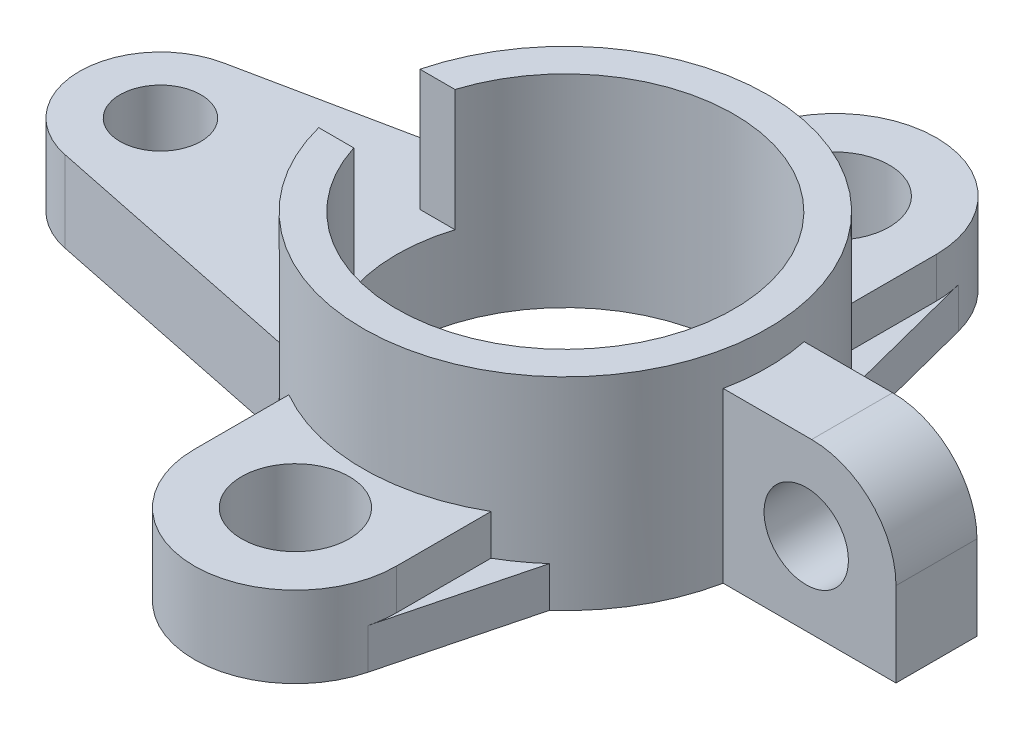
ISO-10303-21;
HEADER;
FILE_DESCRIPTION(('STEP AP214'),'2;1');
FILE_NAME('part.step','',(''),(''),'','','');
FILE_SCHEMA(('AUTOMOTIVE_DESIGN { 1 0 10303 214 1 1 1 1 }'));
ENDSEC;
DATA;
#1=APPLICATION_CONTEXT('core data for automotive mechanical design processes');
#2=APPLICATION_PROTOCOL_DEFINITION('international standard','automotive_design',2000,#1);
#3=PRODUCT_CONTEXT('',#1,'mechanical');
#4=PRODUCT('Part','Part','',(#3));
#5=PRODUCT_RELATED_PRODUCT_CATEGORY('part','',(#4));
#6=PRODUCT_DEFINITION_FORMATION('','',#4);
#7=PRODUCT_DEFINITION_CONTEXT('part definition',#1,'design');
#8=PRODUCT_DEFINITION('design','',#6,#7);
#9=PRODUCT_DEFINITION_SHAPE('','',#8);
#10=(LENGTH_UNIT() NAMED_UNIT(*) SI_UNIT(.MILLI.,.METRE.));
#11=(NAMED_UNIT(*) PLANE_ANGLE_UNIT() SI_UNIT($,.RADIAN.));
#12=(NAMED_UNIT(*) SI_UNIT($,.STERADIAN.) SOLID_ANGLE_UNIT());
#13=UNCERTAINTY_MEASURE_WITH_UNIT(LENGTH_MEASURE(1.E-05),#10,'distance_accuracy_value','');
#14=(GEOMETRIC_REPRESENTATION_CONTEXT(3) GLOBAL_UNCERTAINTY_ASSIGNED_CONTEXT((#13)) GLOBAL_UNIT_ASSIGNED_CONTEXT((#10,
#11,#12)) REPRESENTATION_CONTEXT('',''));
#15=CARTESIAN_POINT('',(0.,0.,0.));
#16=DIRECTION('',(0.,0.,1.));
#17=DIRECTION('',(1.,0.,0.));
#18=AXIS2_PLACEMENT_3D('',#15,#16,#17);
#19=CARTESIAN_POINT('',(0.,30.,0.));
#20=DIRECTION('',(0.,-1.,0.));
#21=DIRECTION('',(0.,0.,-1.));
#22=AXIS2_PLACEMENT_3D('',#19,#20,#21);
#23=CYLINDRICAL_SURFACE('',#22,30.);
#24=CARTESIAN_POINT('',(0.,0.,0.));
#25=DIRECTION('',(0.,1.,0.));
#26=DIRECTION('',(0.,0.,1.));
#27=AXIS2_PLACEMENT_3D('',#24,#25,#26);
#28=CIRCLE('',#27,30.);
#29=CARTESIAN_POINT('',(20.,0.,22.3606797749979));
#30=VERTEX_POINT('',#29);
#31=CARTESIAN_POINT('',(29.3938769133981,0.,6.));
#32=VERTEX_POINT('',#31);
#33=EDGE_CURVE('E455',#30,#32,#28,.T.);
#34=ORIENTED_EDGE('',*,*,#33,.T.);
#35=DIRECTION('',(0.,-1.,0.));
#36=VECTOR('',#35,1.);
#37=CARTESIAN_POINT('',(29.3938769133981,25.,6.));
#38=LINE('',#37,#36);
#39=CARTESIAN_POINT('',(29.3938769133981,25.,6.));
#40=VERTEX_POINT('',#39);
#41=EDGE_CURVE('E229',#40,#32,#38,.T.);
#42=ORIENTED_EDGE('',*,*,#41,.F.);
#43=CARTESIAN_POINT('',(0.,25.,0.));
#44=DIRECTION('',(0.,1.,0.));
#45=DIRECTION('',(0.,0.,1.));
#46=AXIS2_PLACEMENT_3D('',#43,#44,#45);
#47=CIRCLE('',#46,30.);
#48=CARTESIAN_POINT('',(29.3938769133981,25.,-6.));
#49=VERTEX_POINT('',#48);
#50=EDGE_CURVE('E252',#40,#49,#47,.T.);
#51=ORIENTED_EDGE('',*,*,#50,.T.);
#52=DIRECTION('',(0.,-1.,0.));
#53=VECTOR('',#52,1.);
#54=CARTESIAN_POINT('',(29.3938769133981,25.,-6.));
#55=LINE('',#54,#53);
#56=CARTESIAN_POINT('',(29.3938769133981,0.,-6.));
#57=VERTEX_POINT('',#56);
#58=EDGE_CURVE('E253',#49,#57,#55,.T.);
#59=ORIENTED_EDGE('',*,*,#58,.T.);
#60=CARTESIAN_POINT('',(20.,0.,-22.3606797749979));
#61=VERTEX_POINT('',#60);
#62=EDGE_CURVE('E456',#57,#61,#28,.T.);
#63=ORIENTED_EDGE('',*,*,#62,.T.);
#64=DIRECTION('',(0.,-1.,0.));
#65=VECTOR('',#64,1.);
#66=CARTESIAN_POINT('',(20.,6.,-22.3606797749979));
#67=LINE('',#66,#65);
#68=CARTESIAN_POINT('',(20.,6.,-22.3606797749979));
#69=VERTEX_POINT('',#68);
#70=EDGE_CURVE('E268',#69,#61,#67,.T.);
#71=ORIENTED_EDGE('',*,*,#70,.F.);
#72=CARTESIAN_POINT('',(0.,6.,0.));
#73=DIRECTION('',(0.,1.,0.));
#74=DIRECTION('',(0.,0.,1.));
#75=AXIS2_PLACEMENT_3D('',#72,#73,#74);
#76=CIRCLE('',#75,30.);
#77=CARTESIAN_POINT('',(14.978720200918,6.,-25.9930363971317));
#78=VERTEX_POINT('',#77);
#79=EDGE_CURVE('E265',#69,#78,#76,.T.);
#80=ORIENTED_EDGE('',*,*,#79,.T.);
#81=DIRECTION('',(0.,-1.,0.));
#82=VECTOR('',#81,1.);
#83=CARTESIAN_POINT('',(14.978720200918,12.,-25.9930363971317));
#84=LINE('',#83,#82);
#85=CARTESIAN_POINT('',(14.978720200918,12.,-25.9930363971317));
#86=VERTEX_POINT('',#85);
#87=EDGE_CURVE('E353',#86,#78,#84,.T.);
#88=ORIENTED_EDGE('',*,*,#87,.F.);
#89=CARTESIAN_POINT('',(0.,12.,0.));
#90=DIRECTION('',(0.,1.,0.));
#91=DIRECTION('',(0.,0.,1.));
#92=AXIS2_PLACEMENT_3D('',#89,#90,#91);
#93=CIRCLE('',#92,30.);
#94=CARTESIAN_POINT('',(-14.978720200918,12.,-25.9930363971317));
#95=VERTEX_POINT('',#94);
#96=EDGE_CURVE('E341',#86,#95,#93,.T.);
#97=ORIENTED_EDGE('',*,*,#96,.T.);
#98=DIRECTION('',(0.,-1.,0.));
#99=VECTOR('',#98,1.);
#100=CARTESIAN_POINT('',(-14.978720200918,12.,-25.9930363971317));
#101=LINE('',#100,#99);
#102=CARTESIAN_POINT('',(-14.978720200918,6.,-25.9930363971317));
#103=VERTEX_POINT('',#102);
#104=EDGE_CURVE('E356',#95,#103,#101,.T.);
#105=ORIENTED_EDGE('',*,*,#104,.T.);
#106=CARTESIAN_POINT('',(0.,6.,0.));
#107=DIRECTION('',(0.,1.,0.));
#108=DIRECTION('',(0.,0.,1.));
#109=AXIS2_PLACEMENT_3D('',#106,#107,#108);
#110=CIRCLE('',#109,30.);
#111=CARTESIAN_POINT('',(-20.,6.,-22.3606797749979));
#112=VERTEX_POINT('',#111);
#113=EDGE_CURVE('E321',#103,#112,#110,.T.);
#114=ORIENTED_EDGE('',*,*,#113,.T.);
#115=DIRECTION('',(0.,-1.,0.));
#116=VECTOR('',#115,1.);
#117=CARTESIAN_POINT('',(-20.,6.,-22.3606797749979));
#118=LINE('',#117,#116);
#119=CARTESIAN_POINT('',(-20.,0.,-22.3606797749979));
#120=VERTEX_POINT('',#119);
#121=EDGE_CURVE('E323',#112,#120,#118,.T.);
#122=ORIENTED_EDGE('',*,*,#121,.T.);
#123=CARTESIAN_POINT('',(-22.3606797749979,0.,-20.));
#124=VERTEX_POINT('',#123);
#125=EDGE_CURVE('E452',#120,#124,#28,.T.);
#126=ORIENTED_EDGE('',*,*,#125,.T.);
#127=DIRECTION('',(0.,-1.,0.));
#128=VECTOR('',#127,1.);
#129=CARTESIAN_POINT('',(-22.3606797749979,12.,-20.));
#130=LINE('',#129,#128);
#131=CARTESIAN_POINT('',(-22.3606797749979,12.,-20.));
#132=VERTEX_POINT('',#131);
#133=EDGE_CURVE('E426',#132,#124,#130,.T.);
#134=ORIENTED_EDGE('',*,*,#133,.F.);
#135=CARTESIAN_POINT('',(0.,12.,0.));
#136=DIRECTION('',(0.,1.,0.));
#137=DIRECTION('',(0.,0.,1.));
#138=AXIS2_PLACEMENT_3D('',#135,#136,#137);
#139=CIRCLE('',#138,30.);
#140=CARTESIAN_POINT('',(-29.0473750965556,12.,-7.5));
#141=VERTEX_POINT('',#140);
#142=EDGE_CURVE('E410',#132,#141,#139,.T.);
#143=ORIENTED_EDGE('',*,*,#142,.T.);
#144=DIRECTION('',(0.,-1.,0.));
#145=VECTOR('',#144,1.);
#146=CARTESIAN_POINT('',(-29.0473750965556,30.,-7.5));
#147=LINE('',#146,#145);
#148=CARTESIAN_POINT('',(-29.0473750965556,30.,-7.5));
#149=VERTEX_POINT('',#148);
#150=EDGE_CURVE('E459',#149,#141,#147,.T.);
#151=ORIENTED_EDGE('',*,*,#150,.F.);
#152=CARTESIAN_POINT('',(0.,30.,0.));
#153=DIRECTION('',(0.,1.,0.));
#154=DIRECTION('',(0.,0.,1.));
#155=AXIS2_PLACEMENT_3D('',#152,#153,#154);
#156=CIRCLE('',#155,30.);
#157=CARTESIAN_POINT('',(-29.0473750965556,30.,7.50000000000001));
#158=VERTEX_POINT('',#157);
#159=EDGE_CURVE('E445',#158,#149,#156,.T.);
#160=ORIENTED_EDGE('',*,*,#159,.F.);
#161=DIRECTION('',(0.,-1.,0.));
#162=VECTOR('',#161,1.);
#163=CARTESIAN_POINT('',(-29.0473750965556,30.,7.50000000000001));
#164=LINE('',#163,#162);
#165=CARTESIAN_POINT('',(-29.0473750965556,12.,7.50000000000001));
#166=VERTEX_POINT('',#165);
#167=EDGE_CURVE('E462',#158,#166,#164,.T.);
#168=ORIENTED_EDGE('',*,*,#167,.T.);
#169=CARTESIAN_POINT('',(-22.3606797749979,12.,20.));
#170=VERTEX_POINT('',#169);
#171=EDGE_CURVE('E406',#166,#170,#139,.T.);
#172=ORIENTED_EDGE('',*,*,#171,.T.);
#173=DIRECTION('',(0.,-1.,0.));
#174=VECTOR('',#173,1.);
#175=CARTESIAN_POINT('',(-22.3606797749979,12.,20.));
#176=LINE('',#175,#174);
#177=CARTESIAN_POINT('',(-22.3606797749979,0.,20.));
#178=VERTEX_POINT('',#177);
#179=EDGE_CURVE('E429',#170,#178,#176,.T.);
#180=ORIENTED_EDGE('',*,*,#179,.T.);
#181=CARTESIAN_POINT('',(-20.,0.,22.3606797749979));
#182=VERTEX_POINT('',#181);
#183=EDGE_CURVE('E442',#178,#182,#28,.T.);
#184=ORIENTED_EDGE('',*,*,#183,.T.);
#185=DIRECTION('',(0.,-1.,0.));
#186=VECTOR('',#185,1.);
#187=CARTESIAN_POINT('',(-20.,6.,22.3606797749979));
#188=LINE('',#187,#186);
#189=CARTESIAN_POINT('',(-20.,6.,22.3606797749979));
#190=VERTEX_POINT('',#189);
#191=EDGE_CURVE('E310',#190,#182,#188,.T.);
#192=ORIENTED_EDGE('',*,*,#191,.F.);
#193=CARTESIAN_POINT('',(0.,6.,0.));
#194=DIRECTION('',(0.,1.,0.));
#195=DIRECTION('',(0.,0.,1.));
#196=AXIS2_PLACEMENT_3D('',#193,#194,#195);
#197=CIRCLE('',#196,30.);
#198=CARTESIAN_POINT('',(-14.978720200918,6.,25.9930363971317));
#199=VERTEX_POINT('',#198);
#200=EDGE_CURVE('E299',#190,#199,#197,.T.);
#201=ORIENTED_EDGE('',*,*,#200,.T.);
#202=DIRECTION('',(0.,-1.,0.));
#203=VECTOR('',#202,1.);
#204=CARTESIAN_POINT('',(-14.978720200918,12.,25.9930363971317));
#205=LINE('',#204,#203);
#206=CARTESIAN_POINT('',(-14.978720200918,12.,25.9930363971317));
#207=VERTEX_POINT('',#206);
#208=EDGE_CURVE('E384',#207,#199,#205,.T.);
#209=ORIENTED_EDGE('',*,*,#208,.F.);
#210=CARTESIAN_POINT('',(0.,12.,0.));
#211=DIRECTION('',(0.,1.,0.));
#212=DIRECTION('',(0.,0.,1.));
#213=AXIS2_PLACEMENT_3D('',#210,#211,#212);
#214=CIRCLE('',#213,30.);
#215=CARTESIAN_POINT('',(14.978720200918,12.,25.9930363971317));
#216=VERTEX_POINT('',#215);
#217=EDGE_CURVE('E373',#207,#216,#214,.T.);
#218=ORIENTED_EDGE('',*,*,#217,.T.);
#219=DIRECTION('',(0.,-1.,0.));
#220=VECTOR('',#219,1.);
#221=CARTESIAN_POINT('',(14.978720200918,12.,25.9930363971317));
#222=LINE('',#221,#220);
#223=CARTESIAN_POINT('',(14.978720200918,6.,25.9930363971317));
#224=VERTEX_POINT('',#223);
#225=EDGE_CURVE('E387',#216,#224,#222,.T.);
#226=ORIENTED_EDGE('',*,*,#225,.T.);
#227=CARTESIAN_POINT('',(0.,6.,0.));
#228=DIRECTION('',(0.,1.,0.));
#229=DIRECTION('',(0.,0.,1.));
#230=AXIS2_PLACEMENT_3D('',#227,#228,#229);
#231=CIRCLE('',#230,30.);
#232=CARTESIAN_POINT('',(20.,6.,22.3606797749979));
#233=VERTEX_POINT('',#232);
#234=EDGE_CURVE('E282',#224,#233,#231,.T.);
#235=ORIENTED_EDGE('',*,*,#234,.T.);
#236=DIRECTION('',(0.,-1.,0.));
#237=VECTOR('',#236,1.);
#238=CARTESIAN_POINT('',(20.,6.,22.3606797749979));
#239=LINE('',#238,#237);
#240=EDGE_CURVE('E286',#233,#30,#239,.T.);
#241=ORIENTED_EDGE('',*,*,#240,.T.);
#242=EDGE_LOOP('',(#34,#42,#51,#59,#63,#71,#80,#88,#97,#105,#114,#122,#126,#134,#143,#151,#160,
#168,#172,#180,#184,#192,#201,#209,#218,#226,#235,#241));
#243=FACE_BOUND('',#242,.T.);
#244=ADVANCED_FACE('F33',(#243),#23,.T.);
#245=CARTESIAN_POINT('',(0.,12.,40.));
#246=DIRECTION('',(0.,-1.,0.));
#247=DIRECTION('',(0.,0.,-1.));
#248=AXIS2_PLACEMENT_3D('',#245,#246,#247);
#249=CYLINDRICAL_SURFACE('',#248,14.978720200918);
#250=DIRECTION('',(0.,-1.,0.));
#251=VECTOR('',#250,1.);
#252=CARTESIAN_POINT('',(14.5070849084416,6.,43.7291482025598));
#253=LINE('',#252,#251);
#254=CARTESIAN_POINT('',(14.5070849084416,6.,43.7291482025598));
#255=VERTEX_POINT('',#254);
#256=CARTESIAN_POINT('',(14.5070849084416,0.,43.7291482025598));
#257=VERTEX_POINT('',#256);
#258=EDGE_CURVE('E290',#255,#257,#253,.T.);
#259=ORIENTED_EDGE('',*,*,#258,.F.);
#260=CARTESIAN_POINT('',(0.,6.,40.));
#261=DIRECTION('',(0.,1.,0.));
#262=DIRECTION('',(0.,0.,1.));
#263=AXIS2_PLACEMENT_3D('',#260,#261,#262);
#264=CIRCLE('',#263,14.978720200918);
#265=CARTESIAN_POINT('',(14.978720200918,6.,40.));
#266=VERTEX_POINT('',#265);
#267=EDGE_CURVE('E277',#255,#266,#264,.T.);
#268=ORIENTED_EDGE('',*,*,#267,.T.);
#269=DIRECTION('',(0.,-1.,0.));
#270=VECTOR('',#269,1.);
#271=CARTESIAN_POINT('',(14.978720200918,12.,40.));
#272=LINE('',#271,#270);
#273=CARTESIAN_POINT('',(14.978720200918,12.,40.));
#274=VERTEX_POINT('',#273);
#275=EDGE_CURVE('E390',#274,#266,#272,.T.);
#276=ORIENTED_EDGE('',*,*,#275,.F.);
#277=CARTESIAN_POINT('',(0.,12.,40.));
#278=DIRECTION('',(0.,1.,0.));
#279=DIRECTION('',(0.,0.,1.));
#280=AXIS2_PLACEMENT_3D('',#277,#278,#279);
#281=CIRCLE('',#280,14.978720200918);
#282=CARTESIAN_POINT('',(-14.9787202009179,12.,40.));
#283=VERTEX_POINT('',#282);
#284=EDGE_CURVE('E366',#283,#274,#281,.T.);
#285=ORIENTED_EDGE('',*,*,#284,.F.);
#286=DIRECTION('',(0.,-1.,0.));
#287=VECTOR('',#286,1.);
#288=CARTESIAN_POINT('',(-14.9787202009179,12.,40.));
#289=LINE('',#288,#287);
#290=CARTESIAN_POINT('',(-14.9787202009179,6.,40.));
#291=VERTEX_POINT('',#290);
#292=EDGE_CURVE('E378',#283,#291,#289,.T.);
#293=ORIENTED_EDGE('',*,*,#292,.T.);
#294=CARTESIAN_POINT('',(0.,6.,40.));
#295=DIRECTION('',(0.,1.,0.));
#296=DIRECTION('',(0.,0.,1.));
#297=AXIS2_PLACEMENT_3D('',#294,#295,#296);
#298=CIRCLE('',#297,14.978720200918);
#299=CARTESIAN_POINT('',(-14.5070849084415,6.,43.7291482025598));
#300=VERTEX_POINT('',#299);
#301=EDGE_CURVE('E294',#291,#300,#298,.T.);
#302=ORIENTED_EDGE('',*,*,#301,.T.);
#303=DIRECTION('',(0.,-1.,0.));
#304=VECTOR('',#303,1.);
#305=CARTESIAN_POINT('',(-14.5070849084415,6.,43.7291482025598));
#306=LINE('',#305,#304);
#307=CARTESIAN_POINT('',(-14.5070849084415,0.,43.7291482025598));
#308=VERTEX_POINT('',#307);
#309=EDGE_CURVE('E305',#300,#308,#306,.T.);
#310=ORIENTED_EDGE('',*,*,#309,.T.);
#311=CARTESIAN_POINT('',(0.,0.,40.));
#312=DIRECTION('',(0.,1.,0.));
#313=DIRECTION('',(0.,0.,1.));
#314=AXIS2_PLACEMENT_3D('',#311,#312,#313);
#315=CIRCLE('',#314,14.978720200918);
#316=EDGE_CURVE('E367',#308,#257,#315,.T.);
#317=ORIENTED_EDGE('',*,*,#316,.T.);
#318=EDGE_LOOP('',(#259,#268,#276,#285,#293,#302,#310,#317));
#319=FACE_BOUND('',#318,.T.);
#320=ADVANCED_FACE('F502',(#319),#249,.T.);
#321=CARTESIAN_POINT('',(0.,12.,-40.));
#322=DIRECTION('',(0.,-1.,0.));
#323=DIRECTION('',(0.,0.,-1.));
#324=AXIS2_PLACEMENT_3D('',#321,#322,#323);
#325=CYLINDRICAL_SURFACE('',#324,14.978720200918);
#326=DIRECTION('',(0.,-1.,0.));
#327=VECTOR('',#326,1.);
#328=CARTESIAN_POINT('',(14.5070849084416,6.,-43.7291482025598));
#329=LINE('',#328,#327);
#330=CARTESIAN_POINT('',(14.5070849084416,6.,-43.7291482025598));
#331=VERTEX_POINT('',#330);
#332=CARTESIAN_POINT('',(14.5070849084416,0.,-43.7291482025598));
#333=VERTEX_POINT('',#332);
#334=EDGE_CURVE('E273',#331,#333,#329,.T.);
#335=ORIENTED_EDGE('',*,*,#334,.T.);
#336=CARTESIAN_POINT('',(0.,0.,-40.));
#337=DIRECTION('',(0.,1.,0.));
#338=DIRECTION('',(0.,0.,1.));
#339=AXIS2_PLACEMENT_3D('',#336,#337,#338);
#340=CIRCLE('',#339,14.978720200918);
#341=CARTESIAN_POINT('',(-14.5070849084416,0.,-43.7291482025598));
#342=VERTEX_POINT('',#341);
#343=EDGE_CURVE('E335',#342,#333,#340,.F.);
#344=ORIENTED_EDGE('',*,*,#343,.F.);
#345=DIRECTION('',(0.,-1.,0.));
#346=VECTOR('',#345,1.);
#347=CARTESIAN_POINT('',(-14.5070849084416,6.,-43.7291482025598));
#348=LINE('',#347,#346);
#349=CARTESIAN_POINT('',(-14.5070849084416,6.,-43.7291482025598));
#350=VERTEX_POINT('',#349);
#351=EDGE_CURVE('E327',#350,#342,#348,.T.);
#352=ORIENTED_EDGE('',*,*,#351,.F.);
#353=CARTESIAN_POINT('',(0.,6.,-40.));
#354=DIRECTION('',(0.,1.,0.));
#355=DIRECTION('',(0.,0.,1.));
#356=AXIS2_PLACEMENT_3D('',#353,#354,#355);
#357=CIRCLE('',#356,14.978720200918);
#358=CARTESIAN_POINT('',(-14.978720200918,6.,-40.));
#359=VERTEX_POINT('',#358);
#360=EDGE_CURVE('E315',#359,#350,#357,.F.);
#361=ORIENTED_EDGE('',*,*,#360,.F.);
#362=DIRECTION('',(0.,-1.,0.));
#363=VECTOR('',#362,1.);
#364=CARTESIAN_POINT('',(-14.978720200918,12.,-40.));
#365=LINE('',#364,#363);
#366=CARTESIAN_POINT('',(-14.978720200918,12.,-40.));
#367=VERTEX_POINT('',#366);
#368=EDGE_CURVE('E359',#367,#359,#365,.T.);
#369=ORIENTED_EDGE('',*,*,#368,.F.);
#370=CARTESIAN_POINT('',(0.,12.,-40.));
#371=DIRECTION('',(0.,1.,0.));
#372=DIRECTION('',(0.,0.,1.));
#373=AXIS2_PLACEMENT_3D('',#370,#371,#372);
#374=CIRCLE('',#373,14.978720200918);
#375=CARTESIAN_POINT('',(14.978720200918,12.,-40.));
#376=VERTEX_POINT('',#375);
#377=EDGE_CURVE('E334',#367,#376,#374,.F.);
#378=ORIENTED_EDGE('',*,*,#377,.T.);
#379=DIRECTION('',(0.,-1.,0.));
#380=VECTOR('',#379,1.);
#381=CARTESIAN_POINT('',(14.978720200918,12.,-40.));
#382=LINE('',#381,#380);
#383=CARTESIAN_POINT('',(14.978720200918,6.,-40.));
#384=VERTEX_POINT('',#383);
#385=EDGE_CURVE('E346',#376,#384,#382,.T.);
#386=ORIENTED_EDGE('',*,*,#385,.T.);
#387=CARTESIAN_POINT('',(0.,6.,-40.));
#388=DIRECTION('',(0.,1.,0.));
#389=DIRECTION('',(0.,0.,1.));
#390=AXIS2_PLACEMENT_3D('',#387,#388,#389);
#391=CIRCLE('',#390,14.978720200918);
#392=EDGE_CURVE('E261',#331,#384,#391,.F.);
#393=ORIENTED_EDGE('',*,*,#392,.F.);
#394=EDGE_LOOP('',(#335,#344,#352,#361,#369,#378,#386,#393));
#395=FACE_BOUND('',#394,.T.);
#396=ADVANCED_FACE('F508',(#395),#325,.T.);
#397=CARTESIAN_POINT('',(0.,30.,0.));
#398=DIRECTION('',(0.,-1.,0.));
#399=DIRECTION('',(0.,0.,-1.));
#400=AXIS2_PLACEMENT_3D('',#397,#398,#399);
#401=CYLINDRICAL_SURFACE('',#400,25.);
#402=CARTESIAN_POINT('',(0.,0.,0.));
#403=DIRECTION('',(0.,1.,0.));
#404=DIRECTION('',(0.,0.,1.));
#405=AXIS2_PLACEMENT_3D('',#402,#403,#404);
#406=CIRCLE('',#405,25.);
#407=CARTESIAN_POINT('',(0.,0.,25.));
#408=VERTEX_POINT('',#407);
#409=EDGE_CURVE('E437',#408,#408,#406,.T.);
#410=ORIENTED_EDGE('',*,*,#409,.F.);
#411=EDGE_LOOP('',(#410));
#412=FACE_BOUND('',#411,.T.);
#413=CARTESIAN_POINT('',(0.,12.,0.));
#414=DIRECTION('',(0.,1.,0.));
#415=DIRECTION('',(0.,0.,1.));
#416=AXIS2_PLACEMENT_3D('',#413,#414,#415);
#417=CIRCLE('',#416,25.);
#418=CARTESIAN_POINT('',(-23.8484800354236,12.,-7.5));
#419=VERTEX_POINT('',#418);
#420=CARTESIAN_POINT('',(-23.8484800354236,12.,7.5));
#421=VERTEX_POINT('',#420);
#422=EDGE_CURVE('E412',#419,#421,#417,.T.);
#423=ORIENTED_EDGE('',*,*,#422,.T.);
#424=DIRECTION('',(0.,-1.,0.));
#425=VECTOR('',#424,1.);
#426=CARTESIAN_POINT('',(-23.8484800354236,30.,7.5));
#427=LINE('',#426,#425);
#428=CARTESIAN_POINT('',(-23.8484800354236,30.,7.5));
#429=VERTEX_POINT('',#428);
#430=EDGE_CURVE('E465',#429,#421,#427,.T.);
#431=ORIENTED_EDGE('',*,*,#430,.F.);
#432=CARTESIAN_POINT('',(0.,30.,0.));
#433=DIRECTION('',(0.,1.,0.));
#434=DIRECTION('',(0.,0.,1.));
#435=AXIS2_PLACEMENT_3D('',#432,#433,#434);
#436=CIRCLE('',#435,25.);
#437=CARTESIAN_POINT('',(-23.8484800354236,30.,-7.5));
#438=VERTEX_POINT('',#437);
#439=EDGE_CURVE('E438',#429,#438,#436,.T.);
#440=ORIENTED_EDGE('',*,*,#439,.T.);
#441=DIRECTION('',(0.,-1.,0.));
#442=VECTOR('',#441,1.);
#443=CARTESIAN_POINT('',(-23.8484800354236,30.,-7.5));
#444=LINE('',#443,#442);
#445=EDGE_CURVE('E449',#438,#419,#444,.T.);
#446=ORIENTED_EDGE('',*,*,#445,.T.);
#447=EDGE_LOOP('',(#423,#431,#440,#446));
#448=FACE_BOUND('',#447,.T.);
#449=ADVANCED_FACE('F517',(#412,#448),#401,.F.);
#450=CARTESIAN_POINT('',(0.,30.,7.5));
#451=DIRECTION('',(0.,0.,-1.));
#452=DIRECTION('',(-1.,0.,0.));
#453=AXIS2_PLACEMENT_3D('',#450,#451,#452);
#454=PLANE('',#453);
#455=DIRECTION('',(1.,0.,0.));
#456=VECTOR('',#455,1.);
#457=CARTESIAN_POINT('',(0.,12.,7.5));
#458=LINE('',#457,#456);
#459=EDGE_CURVE('E409',#166,#421,#458,.T.);
#460=ORIENTED_EDGE('',*,*,#459,.F.);
#461=ORIENTED_EDGE('',*,*,#167,.F.);
#462=DIRECTION('',(1.,0.,0.));
#463=VECTOR('',#462,1.);
#464=CARTESIAN_POINT('',(0.,30.,7.5));
#465=LINE('',#464,#463);
#466=EDGE_CURVE('E441',#158,#429,#465,.T.);
#467=ORIENTED_EDGE('',*,*,#466,.T.);
#468=ORIENTED_EDGE('',*,*,#430,.T.);
#469=EDGE_LOOP('',(#460,#461,#467,#468));
#470=FACE_BOUND('',#469,.T.);
#471=ADVANCED_FACE('F515',(#470),#454,.T.);
#472=CARTESIAN_POINT('',(0.,30.,-7.50000000000001));
#473=DIRECTION('',(0.,0.,-1.));
#474=DIRECTION('',(-1.,0.,0.));
#475=AXIS2_PLACEMENT_3D('',#472,#473,#474);
#476=PLANE('',#475);
#477=ORIENTED_EDGE('',*,*,#150,.T.);
#478=DIRECTION('',(1.,0.,0.));
#479=VECTOR('',#478,1.);
#480=CARTESIAN_POINT('',(0.,12.,-7.50000000000001));
#481=LINE('',#480,#479);
#482=EDGE_CURVE('E415',#141,#419,#481,.T.);
#483=ORIENTED_EDGE('',*,*,#482,.T.);
#484=ORIENTED_EDGE('',*,*,#445,.F.);
#485=DIRECTION('',(1.,0.,0.));
#486=VECTOR('',#485,1.);
#487=CARTESIAN_POINT('',(0.,30.,-7.50000000000001));
#488=LINE('',#487,#486);
#489=EDGE_CURVE('E447',#149,#438,#488,.T.);
#490=ORIENTED_EDGE('',*,*,#489,.F.);
#491=EDGE_LOOP('',(#477,#483,#484,#490));
#492=FACE_BOUND('',#491,.T.);
#493=ADVANCED_FACE('F513',(#492),#476,.F.);
#494=CARTESIAN_POINT('',(0.,30.,0.));
#495=DIRECTION('',(0.,1.,0.));
#496=DIRECTION('',(0.,0.,1.));
#497=AXIS2_PLACEMENT_3D('',#494,#495,#496);
#498=PLANE('',#497);
#499=ORIENTED_EDGE('',*,*,#439,.F.);
#500=ORIENTED_EDGE('',*,*,#466,.F.);
#501=ORIENTED_EDGE('',*,*,#159,.T.);
#502=ORIENTED_EDGE('',*,*,#489,.T.);
#503=EDGE_LOOP('',(#499,#500,#501,#502));
#504=FACE_BOUND('',#503,.T.);
#505=ADVANCED_FACE('F537',(#504),#498,.T.);
#506=CARTESIAN_POINT('',(0.,0.,0.));
#507=DIRECTION('',(0.,1.,0.));
#508=DIRECTION('',(0.,0.,1.));
#509=AXIS2_PLACEMENT_3D('',#506,#507,#508);
#510=PLANE('',#509);
#511=ORIENTED_EDGE('',*,*,#33,.F.);
#512=DIRECTION('',(0.248963072448023,0.,-0.968512978001452));
#513=VECTOR('',#512,1.);
#514=CARTESIAN_POINT('',(24.1520435768026,0.,6.20845266027018));
#515=LINE('',#514,#513);
#516=EDGE_CURVE('E276',#257,#30,#515,.T.);
#517=ORIENTED_EDGE('',*,*,#516,.F.);
#518=ORIENTED_EDGE('',*,*,#316,.F.);
#519=DIRECTION('',(-0.248963072448023,0.,-0.968512978001452));
#520=VECTOR('',#519,1.);
#521=CARTESIAN_POINT('',(-24.1520435768026,0.,6.20845266027018));
#522=LINE('',#521,#520);
#523=EDGE_CURVE('E293',#308,#182,#522,.T.);
#524=ORIENTED_EDGE('',*,*,#523,.T.);
#525=ORIENTED_EDGE('',*,*,#183,.F.);
#526=DIRECTION('',(0.979461667767342,0.,0.201630457457243));
#527=VECTOR('',#526,1.);
#528=CARTESIAN_POINT('',(-4.85885597195194,0.,23.6028982612339));
#529=LINE('',#528,#527);
#530=CARTESIAN_POINT('',(-62.4195654894869,0.,11.7535400132081));
#531=VERTEX_POINT('',#530);
#532=EDGE_CURVE('E398',#531,#178,#529,.T.);
#533=ORIENTED_EDGE('',*,*,#532,.F.);
#534=CARTESIAN_POINT('',(-60.,0.,0.));
#535=DIRECTION('',(0.,1.,0.));
#536=DIRECTION('',(0.,0.,1.));
#537=AXIS2_PLACEMENT_3D('',#534,#535,#536);
#538=CIRCLE('',#537,12.);
#539=CARTESIAN_POINT('',(-62.4195654894869,0.,-11.7535400132081));
#540=VERTEX_POINT('',#539);
#541=EDGE_CURVE('E422',#540,#531,#538,.T.);
#542=ORIENTED_EDGE('',*,*,#541,.F.);
#543=DIRECTION('',(0.979461667767342,0.,-0.201630457457243));
#544=VECTOR('',#543,1.);
#545=CARTESIAN_POINT('',(-4.85885597195195,0.,-23.6028982612339));
#546=LINE('',#545,#544);
#547=EDGE_CURVE('E419',#540,#124,#546,.T.);
#548=ORIENTED_EDGE('',*,*,#547,.T.);
#549=ORIENTED_EDGE('',*,*,#125,.F.);
#550=DIRECTION('',(-0.248963072448022,0.,0.968512978001452));
#551=VECTOR('',#550,1.);
#552=CARTESIAN_POINT('',(-24.1520435768026,0.,-6.20845266027016));
#553=LINE('',#552,#551);
#554=EDGE_CURVE('E312',#342,#120,#553,.T.);
#555=ORIENTED_EDGE('',*,*,#554,.F.);
#556=ORIENTED_EDGE('',*,*,#343,.T.);
#557=DIRECTION('',(0.248963072448023,0.,0.968512978001452));
#558=VECTOR('',#557,1.);
#559=CARTESIAN_POINT('',(24.1520435768026,0.,-6.20845266027019));
#560=LINE('',#559,#558);
#561=EDGE_CURVE('E258',#333,#61,#560,.T.);
#562=ORIENTED_EDGE('',*,*,#561,.T.);
#563=ORIENTED_EDGE('',*,*,#62,.F.);
#564=DIRECTION('',(-1.,0.,0.));
#565=VECTOR('',#564,1.);
#566=CARTESIAN_POINT('',(0.,0.,-6.00000000000001));
#567=LINE('',#566,#565);
#568=CARTESIAN_POINT('',(55.,0.,-6.));
#569=VERTEX_POINT('',#568);
#570=EDGE_CURVE('E239',#569,#57,#567,.T.);
#571=ORIENTED_EDGE('',*,*,#570,.F.);
#572=DIRECTION('',(0.,0.,-1.));
#573=VECTOR('',#572,1.);
#574=CARTESIAN_POINT('',(55.,0.,0.));
#575=LINE('',#574,#573);
#576=CARTESIAN_POINT('',(55.,0.,6.));
#577=VERTEX_POINT('',#576);
#578=EDGE_CURVE('E224',#577,#569,#575,.T.);
#579=ORIENTED_EDGE('',*,*,#578,.F.);
#580=DIRECTION('',(-1.,0.,0.));
#581=VECTOR('',#580,1.);
#582=CARTESIAN_POINT('',(0.,0.,6.00000000000001));
#583=LINE('',#582,#581);
#584=EDGE_CURVE('E237',#577,#32,#583,.T.);
#585=ORIENTED_EDGE('',*,*,#584,.T.);
#586=EDGE_LOOP('',(#511,#517,#518,#524,#525,#533,#542,#548,#549,#555,#556,#562,#563,#571,#579,#585));
#587=FACE_BOUND('',#586,.T.);
#588=ORIENTED_EDGE('',*,*,#409,.T.);
#589=EDGE_LOOP('',(#588));
#590=FACE_BOUND('',#589,.T.);
#591=CARTESIAN_POINT('',(-60.,0.,0.));
#592=DIRECTION('',(0.,1.,0.));
#593=DIRECTION('',(0.,0.,1.));
#594=AXIS2_PLACEMENT_3D('',#591,#592,#593);
#595=CIRCLE('',#594,6.);
#596=CARTESIAN_POINT('',(-60.,0.,6.00000000000001));
#597=VERTEX_POINT('',#596);
#598=EDGE_CURVE('E393',#597,#597,#595,.T.);
#599=ORIENTED_EDGE('',*,*,#598,.T.);
#600=EDGE_LOOP('',(#599));
#601=FACE_BOUND('',#600,.T.);
#602=CARTESIAN_POINT('',(0.,0.,40.));
#603=DIRECTION('',(0.,1.,0.));
#604=DIRECTION('',(0.,0.,1.));
#605=AXIS2_PLACEMENT_3D('',#602,#603,#604);
#606=CIRCLE('',#605,7.98774976804091);
#607=CARTESIAN_POINT('',(0.,0.,47.9877497680409));
#608=VERTEX_POINT('',#607);
#609=EDGE_CURVE('E362',#608,#608,#606,.F.);
#610=ORIENTED_EDGE('',*,*,#609,.F.);
#611=EDGE_LOOP('',(#610));
#612=FACE_BOUND('',#611,.T.);
#613=CARTESIAN_POINT('',(0.,0.,-40.));
#614=DIRECTION('',(0.,1.,0.));
#615=DIRECTION('',(0.,0.,1.));
#616=AXIS2_PLACEMENT_3D('',#613,#614,#615);
#617=CIRCLE('',#616,7.98774976804091);
#618=CARTESIAN_POINT('',(0.,0.,-32.0122502319591));
#619=VERTEX_POINT('',#618);
#620=EDGE_CURVE('E330',#619,#619,#617,.T.);
#621=ORIENTED_EDGE('',*,*,#620,.T.);
#622=EDGE_LOOP('',(#621));
#623=FACE_BOUND('',#622,.T.);
#624=ADVANCED_FACE('F235',(#587,#590,#601,#612,#623),#510,.F.);
#625=CARTESIAN_POINT('',(-4.85885597195195,12.,-23.6028982612339));
#626=DIRECTION('',(-0.201630457457243,0.,-0.979461667767342));
#627=DIRECTION('',(-0.979461667767342,0.,0.201630457457243));
#628=AXIS2_PLACEMENT_3D('',#625,#626,#627);
#629=PLANE('',#628);
#630=ORIENTED_EDGE('',*,*,#547,.F.);
#631=DIRECTION('',(0.,-1.,0.));
#632=VECTOR('',#631,1.);
#633=CARTESIAN_POINT('',(-62.4195654894869,12.,-11.7535400132081));
#634=LINE('',#633,#632);
#635=CARTESIAN_POINT('',(-62.4195654894869,12.,-11.7535400132081));
#636=VERTEX_POINT('',#635);
#637=EDGE_CURVE('E435',#636,#540,#634,.T.);
#638=ORIENTED_EDGE('',*,*,#637,.F.);
#639=DIRECTION('',(0.979461667767342,0.,-0.201630457457243));
#640=VECTOR('',#639,1.);
#641=CARTESIAN_POINT('',(-4.85885597195195,12.,-23.6028982612339));
#642=LINE('',#641,#640);
#643=EDGE_CURVE('E397',#636,#132,#642,.T.);
#644=ORIENTED_EDGE('',*,*,#643,.T.);
#645=ORIENTED_EDGE('',*,*,#133,.T.);
#646=EDGE_LOOP('',(#630,#638,#644,#645));
#647=FACE_BOUND('',#646,.T.);
#648=ADVANCED_FACE('F547',(#647),#629,.T.);
#649=CARTESIAN_POINT('',(-60.,12.,0.));
#650=DIRECTION('',(0.,-1.,0.));
#651=DIRECTION('',(0.,0.,-1.));
#652=AXIS2_PLACEMENT_3D('',#649,#650,#651);
#653=CYLINDRICAL_SURFACE('',#652,12.);
#654=ORIENTED_EDGE('',*,*,#541,.T.);
#655=DIRECTION('',(0.,-1.,0.));
#656=VECTOR('',#655,1.);
#657=CARTESIAN_POINT('',(-62.4195654894869,12.,11.7535400132081));
#658=LINE('',#657,#656);
#659=CARTESIAN_POINT('',(-62.4195654894869,12.,11.7535400132081));
#660=VERTEX_POINT('',#659);
#661=EDGE_CURVE('E432',#660,#531,#658,.T.);
#662=ORIENTED_EDGE('',*,*,#661,.F.);
#663=CARTESIAN_POINT('',(-60.,12.,0.));
#664=DIRECTION('',(0.,1.,0.));
#665=DIRECTION('',(0.,0.,1.));
#666=AXIS2_PLACEMENT_3D('',#663,#664,#665);
#667=CIRCLE('',#666,12.);
#668=EDGE_CURVE('E401',#636,#660,#667,.T.);
#669=ORIENTED_EDGE('',*,*,#668,.F.);
#670=ORIENTED_EDGE('',*,*,#637,.T.);
#671=EDGE_LOOP('',(#654,#662,#669,#670));
#672=FACE_BOUND('',#671,.T.);
#673=ADVANCED_FACE('F552',(#672),#653,.T.);
#674=CARTESIAN_POINT('',(-4.85885597195194,12.,23.6028982612339));
#675=DIRECTION('',(0.201630457457243,0.,-0.979461667767342));
#676=DIRECTION('',(-0.979461667767342,0.,-0.201630457457243));
#677=AXIS2_PLACEMENT_3D('',#674,#675,#676);
#678=PLANE('',#677);
#679=ORIENTED_EDGE('',*,*,#532,.T.);
#680=ORIENTED_EDGE('',*,*,#179,.F.);
#681=DIRECTION('',(0.979461667767342,0.,0.201630457457243));
#682=VECTOR('',#681,1.);
#683=CARTESIAN_POINT('',(-4.85885597195194,12.,23.6028982612339));
#684=LINE('',#683,#682);
#685=EDGE_CURVE('E404',#660,#170,#684,.T.);
#686=ORIENTED_EDGE('',*,*,#685,.F.);
#687=ORIENTED_EDGE('',*,*,#661,.T.);
#688=EDGE_LOOP('',(#679,#680,#686,#687));
#689=FACE_BOUND('',#688,.T.);
#690=ADVANCED_FACE('F555',(#689),#678,.F.);
#691=CARTESIAN_POINT('',(-60.,12.,0.));
#692=DIRECTION('',(0.,-1.,0.));
#693=DIRECTION('',(0.,0.,-1.));
#694=AXIS2_PLACEMENT_3D('',#691,#692,#693);
#695=CYLINDRICAL_SURFACE('',#694,6.);
#696=CARTESIAN_POINT('',(-60.,12.,0.));
#697=DIRECTION('',(0.,1.,0.));
#698=DIRECTION('',(0.,0.,1.));
#699=AXIS2_PLACEMENT_3D('',#696,#697,#698);
#700=CIRCLE('',#699,6.);
#701=CARTESIAN_POINT('',(-60.,12.,6.00000000000001));
#702=VERTEX_POINT('',#701);
#703=EDGE_CURVE('E394',#702,#702,#700,.T.);
#704=ORIENTED_EDGE('',*,*,#703,.T.);
#705=EDGE_LOOP('',(#704));
#706=FACE_BOUND('',#705,.T.);
#707=ORIENTED_EDGE('',*,*,#598,.F.);
#708=EDGE_LOOP('',(#707));
#709=FACE_BOUND('',#708,.T.);
#710=ADVANCED_FACE('F640',(#706,#709),#695,.F.);
#711=CARTESIAN_POINT('',(0.,12.,0.));
#712=DIRECTION('',(0.,1.,0.));
#713=DIRECTION('',(0.,0.,1.));
#714=AXIS2_PLACEMENT_3D('',#711,#712,#713);
#715=PLANE('',#714);
#716=ORIENTED_EDGE('',*,*,#703,.F.);
#717=EDGE_LOOP('',(#716));
#718=FACE_BOUND('',#717,.T.);
#719=ORIENTED_EDGE('',*,*,#643,.F.);
#720=ORIENTED_EDGE('',*,*,#668,.T.);
#721=ORIENTED_EDGE('',*,*,#685,.T.);
#722=ORIENTED_EDGE('',*,*,#171,.F.);
#723=ORIENTED_EDGE('',*,*,#459,.T.);
#724=ORIENTED_EDGE('',*,*,#422,.F.);
#725=ORIENTED_EDGE('',*,*,#482,.F.);
#726=ORIENTED_EDGE('',*,*,#142,.F.);
#727=EDGE_LOOP('',(#719,#720,#721,#722,#723,#724,#725,#726));
#728=FACE_BOUND('',#727,.T.);
#729=ADVANCED_FACE('F543',(#718,#728),#715,.T.);
#730=CARTESIAN_POINT('',(14.978720200918,12.,0.));
#731=DIRECTION('',(-1.,0.,0.));
#732=DIRECTION('',(0.,0.,1.));
#733=AXIS2_PLACEMENT_3D('',#730,#731,#732);
#734=PLANE('',#733);
#735=ORIENTED_EDGE('',*,*,#275,.T.);
#736=DIRECTION('',(0.,0.,-1.));
#737=VECTOR('',#736,1.);
#738=CARTESIAN_POINT('',(14.978720200918,6.,0.));
#739=LINE('',#738,#737);
#740=EDGE_CURVE('E284',#266,#224,#739,.T.);
#741=ORIENTED_EDGE('',*,*,#740,.T.);
#742=ORIENTED_EDGE('',*,*,#225,.F.);
#743=DIRECTION('',(0.,0.,-1.));
#744=VECTOR('',#743,1.);
#745=CARTESIAN_POINT('',(14.978720200918,12.,0.));
#746=LINE('',#745,#744);
#747=EDGE_CURVE('E370',#274,#216,#746,.T.);
#748=ORIENTED_EDGE('',*,*,#747,.F.);
#749=EDGE_LOOP('',(#735,#741,#742,#748));
#750=FACE_BOUND('',#749,.T.);
#751=ADVANCED_FACE('F576',(#750),#734,.F.);
#752=CARTESIAN_POINT('',(0.,12.,40.));
#753=DIRECTION('',(0.,-1.,0.));
#754=DIRECTION('',(0.,0.,-1.));
#755=AXIS2_PLACEMENT_3D('',#752,#753,#754);
#756=CYLINDRICAL_SURFACE('',#755,7.98774976804091);
#757=CARTESIAN_POINT('',(0.,12.,40.));
#758=DIRECTION('',(0.,1.,0.));
#759=DIRECTION('',(0.,0.,1.));
#760=AXIS2_PLACEMENT_3D('',#757,#758,#759);
#761=CIRCLE('',#760,7.98774976804091);
#762=CARTESIAN_POINT('',(0.,12.,47.9877497680409));
#763=VERTEX_POINT('',#762);
#764=EDGE_CURVE('E363',#763,#763,#761,.F.);
#765=ORIENTED_EDGE('',*,*,#764,.F.);
#766=EDGE_LOOP('',(#765));
#767=FACE_BOUND('',#766,.T.);
#768=ORIENTED_EDGE('',*,*,#609,.T.);
#769=EDGE_LOOP('',(#768));
#770=FACE_BOUND('',#769,.T.);
#771=ADVANCED_FACE('F632',(#767,#770),#756,.F.);
#772=CARTESIAN_POINT('',(-14.978720200918,12.,0.));
#773=DIRECTION('',(-1.,0.,0.));
#774=DIRECTION('',(0.,0.,1.));
#775=AXIS2_PLACEMENT_3D('',#772,#773,#774);
#776=PLANE('',#775);
#777=DIRECTION('',(0.,0.,-1.));
#778=VECTOR('',#777,1.);
#779=CARTESIAN_POINT('',(-14.978720200918,6.,0.));
#780=LINE('',#779,#778);
#781=EDGE_CURVE('E297',#291,#199,#780,.T.);
#782=ORIENTED_EDGE('',*,*,#781,.F.);
#783=ORIENTED_EDGE('',*,*,#292,.F.);
#784=DIRECTION('',(0.,0.,-1.));
#785=VECTOR('',#784,1.);
#786=CARTESIAN_POINT('',(-14.978720200918,12.,0.));
#787=LINE('',#786,#785);
#788=EDGE_CURVE('E375',#283,#207,#787,.T.);
#789=ORIENTED_EDGE('',*,*,#788,.T.);
#790=ORIENTED_EDGE('',*,*,#208,.T.);
#791=EDGE_LOOP('',(#782,#783,#789,#790));
#792=FACE_BOUND('',#791,.T.);
#793=ADVANCED_FACE('F568',(#792),#776,.T.);
#794=CARTESIAN_POINT('',(0.,12.,0.));
#795=DIRECTION('',(0.,1.,0.));
#796=DIRECTION('',(0.,0.,1.));
#797=AXIS2_PLACEMENT_3D('',#794,#795,#796);
#798=PLANE('',#797);
#799=ORIENTED_EDGE('',*,*,#764,.T.);
#800=EDGE_LOOP('',(#799));
#801=FACE_BOUND('',#800,.T.);
#802=ORIENTED_EDGE('',*,*,#284,.T.);
#803=ORIENTED_EDGE('',*,*,#747,.T.);
#804=ORIENTED_EDGE('',*,*,#217,.F.);
#805=ORIENTED_EDGE('',*,*,#788,.F.);
#806=EDGE_LOOP('',(#802,#803,#804,#805));
#807=FACE_BOUND('',#806,.T.);
#808=ADVANCED_FACE('F572',(#801,#807),#798,.T.);
#809=CARTESIAN_POINT('',(-14.978720200918,12.,0.));
#810=DIRECTION('',(1.,0.,0.));
#811=DIRECTION('',(0.,0.,-1.));
#812=AXIS2_PLACEMENT_3D('',#809,#810,#811);
#813=PLANE('',#812);
#814=ORIENTED_EDGE('',*,*,#368,.T.);
#815=DIRECTION('',(0.,0.,1.));
#816=VECTOR('',#815,1.);
#817=CARTESIAN_POINT('',(-14.978720200918,6.,0.));
#818=LINE('',#817,#816);
#819=EDGE_CURVE('E313',#359,#103,#818,.T.);
#820=ORIENTED_EDGE('',*,*,#819,.T.);
#821=ORIENTED_EDGE('',*,*,#104,.F.);
#822=DIRECTION('',(0.,0.,1.));
#823=VECTOR('',#822,1.);
#824=CARTESIAN_POINT('',(-14.978720200918,12.,0.));
#825=LINE('',#824,#823);
#826=EDGE_CURVE('E338',#367,#95,#825,.T.);
#827=ORIENTED_EDGE('',*,*,#826,.F.);
#828=EDGE_LOOP('',(#814,#820,#821,#827));
#829=FACE_BOUND('',#828,.T.);
#830=ADVANCED_FACE('F602',(#829),#813,.F.);
#831=CARTESIAN_POINT('',(0.,12.,-40.));
#832=DIRECTION('',(0.,-1.,0.));
#833=DIRECTION('',(0.,0.,-1.));
#834=AXIS2_PLACEMENT_3D('',#831,#832,#833);
#835=CYLINDRICAL_SURFACE('',#834,7.98774976804091);
#836=CARTESIAN_POINT('',(0.,12.,-40.));
#837=DIRECTION('',(0.,1.,0.));
#838=DIRECTION('',(0.,0.,1.));
#839=AXIS2_PLACEMENT_3D('',#836,#837,#838);
#840=CIRCLE('',#839,7.98774976804091);
#841=CARTESIAN_POINT('',(0.,12.,-32.0122502319591));
#842=VERTEX_POINT('',#841);
#843=EDGE_CURVE('E331',#842,#842,#840,.T.);
#844=ORIENTED_EDGE('',*,*,#843,.T.);
#845=EDGE_LOOP('',(#844));
#846=FACE_BOUND('',#845,.T.);
#847=ORIENTED_EDGE('',*,*,#620,.F.);
#848=EDGE_LOOP('',(#847));
#849=FACE_BOUND('',#848,.T.);
#850=ADVANCED_FACE('F613',(#846,#849),#835,.F.);
#851=CARTESIAN_POINT('',(14.978720200918,12.,0.));
#852=DIRECTION('',(1.,0.,0.));
#853=DIRECTION('',(0.,0.,-1.));
#854=AXIS2_PLACEMENT_3D('',#851,#852,#853);
#855=PLANE('',#854);
#856=DIRECTION('',(0.,0.,1.));
#857=VECTOR('',#856,1.);
#858=CARTESIAN_POINT('',(14.978720200918,6.,0.));
#859=LINE('',#858,#857);
#860=EDGE_CURVE('E263',#384,#78,#859,.T.);
#861=ORIENTED_EDGE('',*,*,#860,.F.);
#862=ORIENTED_EDGE('',*,*,#385,.F.);
#863=DIRECTION('',(0.,0.,1.));
#864=VECTOR('',#863,1.);
#865=CARTESIAN_POINT('',(14.978720200918,12.,0.));
#866=LINE('',#865,#864);
#867=EDGE_CURVE('E343',#376,#86,#866,.T.);
#868=ORIENTED_EDGE('',*,*,#867,.T.);
#869=ORIENTED_EDGE('',*,*,#87,.T.);
#870=EDGE_LOOP('',(#861,#862,#868,#869));
#871=FACE_BOUND('',#870,.T.);
#872=ADVANCED_FACE('F611',(#871),#855,.T.);
#873=CARTESIAN_POINT('',(0.,12.,0.));
#874=DIRECTION('',(0.,1.,0.));
#875=DIRECTION('',(0.,0.,1.));
#876=AXIS2_PLACEMENT_3D('',#873,#874,#875);
#877=PLANE('',#876);
#878=ORIENTED_EDGE('',*,*,#843,.F.);
#879=EDGE_LOOP('',(#878));
#880=FACE_BOUND('',#879,.T.);
#881=ORIENTED_EDGE('',*,*,#377,.F.);
#882=ORIENTED_EDGE('',*,*,#826,.T.);
#883=ORIENTED_EDGE('',*,*,#96,.F.);
#884=ORIENTED_EDGE('',*,*,#867,.F.);
#885=EDGE_LOOP('',(#881,#882,#883,#884));
#886=FACE_BOUND('',#885,.T.);
#887=ADVANCED_FACE('F608',(#880,#886),#877,.T.);
#888=CARTESIAN_POINT('',(-24.1520435768026,6.,-6.20845266027016));
#889=DIRECTION('',(0.968512978001452,0.,0.248963072448022));
#890=DIRECTION('',(0.248963072448022,0.,-0.968512978001452));
#891=AXIS2_PLACEMENT_3D('',#888,#889,#890);
#892=PLANE('',#891);
#893=ORIENTED_EDGE('',*,*,#554,.T.);
#894=ORIENTED_EDGE('',*,*,#121,.F.);
#895=DIRECTION('',(-0.248963072448022,0.,0.968512978001452));
#896=VECTOR('',#895,1.);
#897=CARTESIAN_POINT('',(-24.1520435768026,6.,-6.20845266027016));
#898=LINE('',#897,#896);
#899=EDGE_CURVE('E318',#350,#112,#898,.T.);
#900=ORIENTED_EDGE('',*,*,#899,.F.);
#901=ORIENTED_EDGE('',*,*,#351,.T.);
#902=EDGE_LOOP('',(#893,#894,#900,#901));
#903=FACE_BOUND('',#902,.T.);
#904=ADVANCED_FACE('F594',(#903),#892,.F.);
#905=CARTESIAN_POINT('',(0.,6.,0.));
#906=DIRECTION('',(0.,1.,0.));
#907=DIRECTION('',(0.,0.,1.));
#908=AXIS2_PLACEMENT_3D('',#905,#906,#907);
#909=PLANE('',#908);
#910=ORIENTED_EDGE('',*,*,#819,.F.);
#911=ORIENTED_EDGE('',*,*,#360,.T.);
#912=ORIENTED_EDGE('',*,*,#899,.T.);
#913=ORIENTED_EDGE('',*,*,#113,.F.);
#914=EDGE_LOOP('',(#910,#911,#912,#913));
#915=FACE_BOUND('',#914,.T.);
#916=ADVANCED_FACE('F599',(#915),#909,.T.);
#917=CARTESIAN_POINT('',(-24.1520435768026,6.,6.20845266027018));
#918=DIRECTION('',(-0.968512978001452,0.,0.248963072448023));
#919=DIRECTION('',(0.248963072448023,0.,0.968512978001452));
#920=AXIS2_PLACEMENT_3D('',#917,#918,#919);
#921=PLANE('',#920);
#922=ORIENTED_EDGE('',*,*,#523,.F.);
#923=ORIENTED_EDGE('',*,*,#309,.F.);
#924=DIRECTION('',(-0.248963072448023,0.,-0.968512978001452));
#925=VECTOR('',#924,1.);
#926=CARTESIAN_POINT('',(-24.1520435768026,6.,6.20845266027018));
#927=LINE('',#926,#925);
#928=EDGE_CURVE('E302',#300,#190,#927,.T.);
#929=ORIENTED_EDGE('',*,*,#928,.T.);
#930=ORIENTED_EDGE('',*,*,#191,.T.);
#931=EDGE_LOOP('',(#922,#923,#929,#930));
#932=FACE_BOUND('',#931,.T.);
#933=ADVANCED_FACE('F561',(#932),#921,.T.);
#934=CARTESIAN_POINT('',(0.,6.,0.));
#935=DIRECTION('',(0.,1.,0.));
#936=DIRECTION('',(0.,0.,1.));
#937=AXIS2_PLACEMENT_3D('',#934,#935,#936);
#938=PLANE('',#937);
#939=ORIENTED_EDGE('',*,*,#301,.F.);
#940=ORIENTED_EDGE('',*,*,#781,.T.);
#941=ORIENTED_EDGE('',*,*,#200,.F.);
#942=ORIENTED_EDGE('',*,*,#928,.F.);
#943=EDGE_LOOP('',(#939,#940,#941,#942));
#944=FACE_BOUND('',#943,.T.);
#945=ADVANCED_FACE('F566',(#944),#938,.T.);
#946=CARTESIAN_POINT('',(24.1520435768026,6.,6.20845266027018));
#947=DIRECTION('',(-0.968512978001452,0.,-0.248963072448023));
#948=DIRECTION('',(-0.248963072448023,0.,0.968512978001452));
#949=AXIS2_PLACEMENT_3D('',#946,#947,#948);
#950=PLANE('',#949);
#951=ORIENTED_EDGE('',*,*,#516,.T.);
#952=ORIENTED_EDGE('',*,*,#240,.F.);
#953=DIRECTION('',(0.248963072448023,0.,-0.968512978001452));
#954=VECTOR('',#953,1.);
#955=CARTESIAN_POINT('',(24.1520435768026,6.,6.20845266027018));
#956=LINE('',#955,#954);
#957=EDGE_CURVE('E279',#255,#233,#956,.T.);
#958=ORIENTED_EDGE('',*,*,#957,.F.);
#959=ORIENTED_EDGE('',*,*,#258,.T.);
#960=EDGE_LOOP('',(#951,#952,#958,#959));
#961=FACE_BOUND('',#960,.T.);
#962=ADVANCED_FACE('F585',(#961),#950,.F.);
#963=CARTESIAN_POINT('',(0.,6.,0.));
#964=DIRECTION('',(0.,1.,0.));
#965=DIRECTION('',(0.,0.,1.));
#966=AXIS2_PLACEMENT_3D('',#963,#964,#965);
#967=PLANE('',#966);
#968=ORIENTED_EDGE('',*,*,#267,.F.);
#969=ORIENTED_EDGE('',*,*,#957,.T.);
#970=ORIENTED_EDGE('',*,*,#234,.F.);
#971=ORIENTED_EDGE('',*,*,#740,.F.);
#972=EDGE_LOOP('',(#968,#969,#970,#971));
#973=FACE_BOUND('',#972,.T.);
#974=ADVANCED_FACE('F581',(#973),#967,.T.);
#975=CARTESIAN_POINT('',(24.1520435768026,6.,-6.20845266027019));
#976=DIRECTION('',(0.968512978001452,0.,-0.248963072448023));
#977=DIRECTION('',(-0.248963072448023,0.,-0.968512978001452));
#978=AXIS2_PLACEMENT_3D('',#975,#976,#977);
#979=PLANE('',#978);
#980=ORIENTED_EDGE('',*,*,#561,.F.);
#981=ORIENTED_EDGE('',*,*,#334,.F.);
#982=DIRECTION('',(0.248963072448023,0.,0.968512978001452));
#983=VECTOR('',#982,1.);
#984=CARTESIAN_POINT('',(24.1520435768026,6.,-6.20845266027019));
#985=LINE('',#984,#983);
#986=EDGE_CURVE('E259',#331,#69,#985,.T.);
#987=ORIENTED_EDGE('',*,*,#986,.T.);
#988=ORIENTED_EDGE('',*,*,#70,.T.);
#989=EDGE_LOOP('',(#980,#981,#987,#988));
#990=FACE_BOUND('',#989,.T.);
#991=ADVANCED_FACE('F498',(#990),#979,.T.);
#992=CARTESIAN_POINT('',(0.,6.,0.));
#993=DIRECTION('',(0.,1.,0.));
#994=DIRECTION('',(0.,0.,1.));
#995=AXIS2_PLACEMENT_3D('',#992,#993,#994);
#996=PLANE('',#995);
#997=ORIENTED_EDGE('',*,*,#986,.F.);
#998=ORIENTED_EDGE('',*,*,#392,.T.);
#999=ORIENTED_EDGE('',*,*,#860,.T.);
#1000=ORIENTED_EDGE('',*,*,#79,.F.);
#1001=EDGE_LOOP('',(#997,#998,#999,#1000));
#1002=FACE_BOUND('',#1001,.T.);
#1003=ADVANCED_FACE('F491',(#1002),#996,.T.);
#1004=CARTESIAN_POINT('',(0.,25.,6.00000000000001));
#1005=DIRECTION('',(0.,0.,1.));
#1006=DIRECTION('',(1.,0.,0.));
#1007=AXIS2_PLACEMENT_3D('',#1004,#1005,#1006);
#1008=PLANE('',#1007);
#1009=CARTESIAN_POINT('',(41.6983530513651,12.2001017091917,6.00000000000001));
#1010=DIRECTION('',(0.,0.,1.));
#1011=DIRECTION('',(1.,0.,0.));
#1012=AXIS2_PLACEMENT_3D('',#1009,#1010,#1011);
#1013=CIRCLE('',#1012,6.25);
#1014=CARTESIAN_POINT('',(47.9483530513651,12.2001017091917,6.00000000000001));
#1015=VERTEX_POINT('',#1014);
#1016=EDGE_CURVE('E246',#1015,#1015,#1013,.T.);
#1017=ORIENTED_EDGE('',*,*,#1016,.F.);
#1018=EDGE_LOOP('',(#1017));
#1019=FACE_BOUND('',#1018,.T.);
#1020=DIRECTION('',(0.,-1.,0.));
#1021=VECTOR('',#1020,1.);
#1022=CARTESIAN_POINT('',(55.,25.,6.));
#1023=LINE('',#1022,#1021);
#1024=CARTESIAN_POINT('',(55.,12.5,6.));
#1025=VERTEX_POINT('',#1024);
#1026=EDGE_CURVE('E221',#1025,#577,#1023,.T.);
#1027=ORIENTED_EDGE('',*,*,#1026,.F.);
#1028=CARTESIAN_POINT('',(42.5,12.5,6.));
#1029=DIRECTION('',(0.,0.,1.));
#1030=DIRECTION('',(1.,0.,0.));
#1031=AXIS2_PLACEMENT_3D('',#1028,#1029,#1030);
#1032=CIRCLE('',#1031,12.5);
#1033=CARTESIAN_POINT('',(42.5,25.,6.));
#1034=VERTEX_POINT('',#1033);
#1035=EDGE_CURVE('E11',#1025,#1034,#1032,.T.);
#1036=ORIENTED_EDGE('',*,*,#1035,.T.);
#1037=DIRECTION('',(-1.,0.,0.));
#1038=VECTOR('',#1037,1.);
#1039=CARTESIAN_POINT('',(0.,25.,6.00000000000001));
#1040=LINE('',#1039,#1038);
#1041=EDGE_CURVE('E478',#1034,#40,#1040,.T.);
#1042=ORIENTED_EDGE('',*,*,#1041,.T.);
#1043=ORIENTED_EDGE('',*,*,#41,.T.);
#1044=ORIENTED_EDGE('',*,*,#584,.F.);
#1045=EDGE_LOOP('',(#1027,#1036,#1042,#1043,#1044));
#1046=FACE_BOUND('',#1045,.T.);
#1047=ADVANCED_FACE('F242',(#1019,#1046),#1008,.T.);
#1048=CARTESIAN_POINT('',(55.,25.,0.));
#1049=DIRECTION('',(-1.,0.,0.));
#1050=DIRECTION('',(0.,0.,1.));
#1051=AXIS2_PLACEMENT_3D('',#1048,#1049,#1050);
#1052=PLANE('',#1051);
#1053=DIRECTION('',(0.,-1.,0.));
#1054=VECTOR('',#1053,1.);
#1055=CARTESIAN_POINT('',(55.,25.,-6.));
#1056=LINE('',#1055,#1054);
#1057=CARTESIAN_POINT('',(55.,12.5,-6.));
#1058=VERTEX_POINT('',#1057);
#1059=EDGE_CURVE('E230',#1058,#569,#1056,.T.);
#1060=ORIENTED_EDGE('',*,*,#1059,.F.);
#1061=DIRECTION('',(0.,0.,-1.));
#1062=VECTOR('',#1061,1.);
#1063=CARTESIAN_POINT('',(55.,12.5,6.));
#1064=LINE('',#1063,#1062);
#1065=EDGE_CURVE('E42',#1058,#1025,#1064,.F.);
#1066=ORIENTED_EDGE('',*,*,#1065,.T.);
#1067=ORIENTED_EDGE('',*,*,#1026,.T.);
#1068=ORIENTED_EDGE('',*,*,#578,.T.);
#1069=EDGE_LOOP('',(#1060,#1066,#1067,#1068));
#1070=FACE_BOUND('',#1069,.T.);
#1071=ADVANCED_FACE('F223',(#1070),#1052,.F.);
#1072=CARTESIAN_POINT('',(0.,25.,-6.00000000000001));
#1073=DIRECTION('',(0.,0.,1.));
#1074=DIRECTION('',(1.,0.,0.));
#1075=AXIS2_PLACEMENT_3D('',#1072,#1073,#1074);
#1076=PLANE('',#1075);
#1077=CARTESIAN_POINT('',(41.6983530513651,12.2001017091917,-6.));
#1078=DIRECTION('',(0.,0.,1.));
#1079=DIRECTION('',(1.,0.,0.));
#1080=AXIS2_PLACEMENT_3D('',#1077,#1078,#1079);
#1081=CIRCLE('',#1080,6.25);
#1082=CARTESIAN_POINT('',(47.9483530513651,12.2001017091917,-6.));
#1083=VERTEX_POINT('',#1082);
#1084=EDGE_CURVE('E37',#1083,#1083,#1081,.T.);
#1085=ORIENTED_EDGE('',*,*,#1084,.T.);
#1086=EDGE_LOOP('',(#1085));
#1087=FACE_BOUND('',#1086,.T.);
#1088=DIRECTION('',(-1.,0.,0.));
#1089=VECTOR('',#1088,1.);
#1090=CARTESIAN_POINT('',(0.,25.,-6.00000000000001));
#1091=LINE('',#1090,#1089);
#1092=CARTESIAN_POINT('',(42.5,25.,-6.));
#1093=VERTEX_POINT('',#1092);
#1094=EDGE_CURVE('E248',#1093,#49,#1091,.T.);
#1095=ORIENTED_EDGE('',*,*,#1094,.F.);
#1096=CARTESIAN_POINT('',(42.5,12.5,-6.));
#1097=DIRECTION('',(0.,0.,1.));
#1098=DIRECTION('',(1.,0.,0.));
#1099=AXIS2_PLACEMENT_3D('',#1096,#1097,#1098);
#1100=CIRCLE('',#1099,12.5);
#1101=EDGE_CURVE('E56',#1093,#1058,#1100,.F.);
#1102=ORIENTED_EDGE('',*,*,#1101,.T.);
#1103=ORIENTED_EDGE('',*,*,#1059,.T.);
#1104=ORIENTED_EDGE('',*,*,#570,.T.);
#1105=ORIENTED_EDGE('',*,*,#58,.F.);
#1106=EDGE_LOOP('',(#1095,#1102,#1103,#1104,#1105));
#1107=FACE_BOUND('',#1106,.T.);
#1108=ADVANCED_FACE('F481',(#1087,#1107),#1076,.F.);
#1109=CARTESIAN_POINT('',(0.,25.,0.));
#1110=DIRECTION('',(0.,1.,0.));
#1111=DIRECTION('',(0.,0.,1.));
#1112=AXIS2_PLACEMENT_3D('',#1109,#1110,#1111);
#1113=PLANE('',#1112);
#1114=ORIENTED_EDGE('',*,*,#1041,.F.);
#1115=DIRECTION('',(0.,0.,-1.));
#1116=VECTOR('',#1115,1.);
#1117=CARTESIAN_POINT('',(42.5,25.,-6.));
#1118=LINE('',#1117,#1116);
#1119=EDGE_CURVE('E468',#1034,#1093,#1118,.T.);
#1120=ORIENTED_EDGE('',*,*,#1119,.T.);
#1121=ORIENTED_EDGE('',*,*,#1094,.T.);
#1122=ORIENTED_EDGE('',*,*,#50,.F.);
#1123=EDGE_LOOP('',(#1114,#1120,#1121,#1122));
#1124=FACE_BOUND('',#1123,.T.);
#1125=ADVANCED_FACE('F475',(#1124),#1113,.T.);
#1126=CARTESIAN_POINT('',(42.5,12.5,0.));
#1127=DIRECTION('',(0.,0.,1.));
#1128=DIRECTION('',(1.,0.,0.));
#1129=AXIS2_PLACEMENT_3D('',#1126,#1127,#1128);
#1130=CYLINDRICAL_SURFACE('',#1129,12.5);
#1131=ORIENTED_EDGE('',*,*,#1035,.F.);
#1132=ORIENTED_EDGE('',*,*,#1065,.F.);
#1133=ORIENTED_EDGE('',*,*,#1101,.F.);
#1134=ORIENTED_EDGE('',*,*,#1119,.F.);
#1135=EDGE_LOOP('',(#1131,#1132,#1133,#1134));
#1136=FACE_BOUND('',#1135,.T.);
#1137=ADVANCED_FACE('F35',(#1136),#1130,.T.);
#1138=CARTESIAN_POINT('',(41.6983530513651,12.2001017091917,-54.978720200918));
#1139=DIRECTION('',(0.,0.,1.));
#1140=DIRECTION('',(1.,0.,0.));
#1141=AXIS2_PLACEMENT_3D('',#1138,#1139,#1140);
#1142=CYLINDRICAL_SURFACE('',#1141,6.25);
#1143=ORIENTED_EDGE('',*,*,#1016,.T.);
#1144=EDGE_LOOP('',(#1143));
#1145=FACE_BOUND('',#1144,.T.);
#1146=ORIENTED_EDGE('',*,*,#1084,.F.);
#1147=EDGE_LOOP('',(#1146));
#1148=FACE_BOUND('',#1147,.T.);
#1149=ADVANCED_FACE('F487',(#1145,#1148),#1142,.F.);
#1150=CLOSED_SHELL('',(#244,#320,#396,#449,#471,#493,#505,#624,#648,#673,#690,#710,#729,#751,
#771,#793,#808,#830,#850,#872,#887,#904,#916,#933,#945,#962,#974,#991,#1003,#1047,#1071,#1108,
#1125,#1137,#1149));
#1151=MANIFOLD_SOLID_BREP('B2',#1150);
#1152=ADVANCED_BREP_SHAPE_REPRESENTATION('',(#18,#1151),#14);
#1153=SHAPE_DEFINITION_REPRESENTATION(#9,#1152);
ENDSEC;
END-ISO-10303-21;
